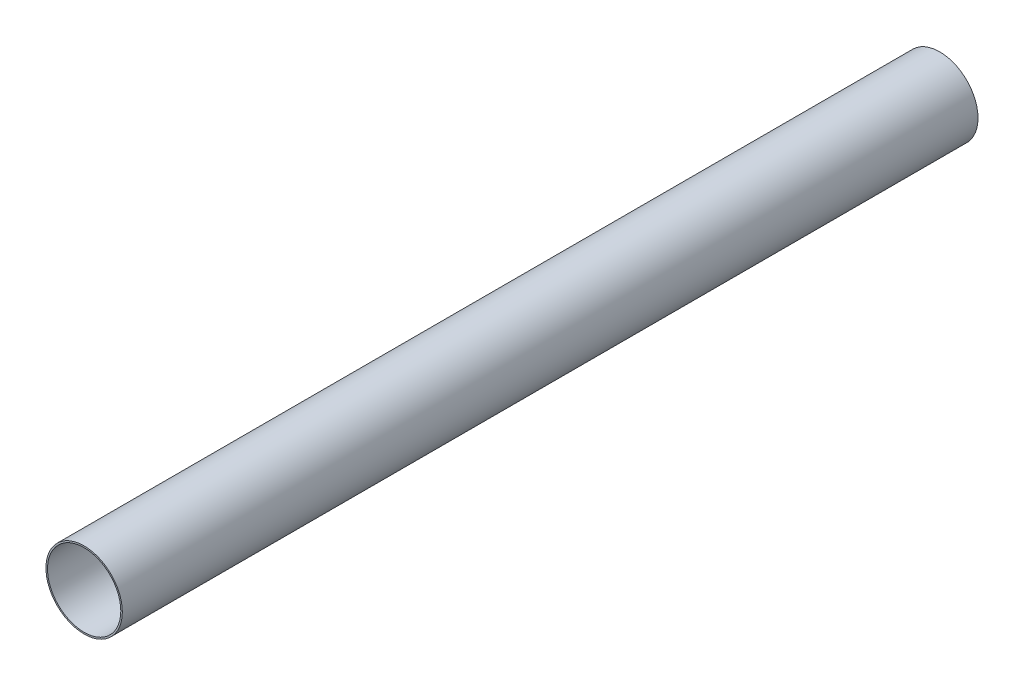
ISO-10303-21;
HEADER;
FILE_DESCRIPTION(('STEP AP214'),'2;1');
FILE_NAME('part.step','',(''),(''),'','','');
FILE_SCHEMA(('AUTOMOTIVE_DESIGN { 1 0 10303 214 1 1 1 1 }'));
ENDSEC;
DATA;
#1=APPLICATION_CONTEXT('core data for automotive mechanical design processes');
#2=APPLICATION_PROTOCOL_DEFINITION('international standard','automotive_design',2000,#1);
#3=PRODUCT_CONTEXT('',#1,'mechanical');
#4=PRODUCT('Part','Part','',(#3));
#5=PRODUCT_RELATED_PRODUCT_CATEGORY('part','',(#4));
#6=PRODUCT_DEFINITION_FORMATION('','',#4);
#7=PRODUCT_DEFINITION_CONTEXT('part definition',#1,'design');
#8=PRODUCT_DEFINITION('design','',#6,#7);
#9=PRODUCT_DEFINITION_SHAPE('','',#8);
#10=(LENGTH_UNIT() NAMED_UNIT(*) SI_UNIT(.MILLI.,.METRE.));
#11=(NAMED_UNIT(*) PLANE_ANGLE_UNIT() SI_UNIT($,.RADIAN.));
#12=(NAMED_UNIT(*) SI_UNIT($,.STERADIAN.) SOLID_ANGLE_UNIT());
#13=UNCERTAINTY_MEASURE_WITH_UNIT(LENGTH_MEASURE(1.E-05),#10,'distance_accuracy_value','');
#14=(GEOMETRIC_REPRESENTATION_CONTEXT(3) GLOBAL_UNCERTAINTY_ASSIGNED_CONTEXT((#13)) GLOBAL_UNIT_ASSIGNED_CONTEXT((#10,
#11,#12)) REPRESENTATION_CONTEXT('',''));
#15=CARTESIAN_POINT('',(0.,0.,0.));
#16=DIRECTION('',(0.,0.,1.));
#17=DIRECTION('',(1.,0.,0.));
#18=AXIS2_PLACEMENT_3D('',#15,#16,#17);
#19=CARTESIAN_POINT('',(0.,0.,1778.));
#20=DIRECTION('',(0.,0.,1.));
#21=DIRECTION('',(1.,0.,0.));
#22=AXIS2_PLACEMENT_3D('',#19,#20,#21);
#23=PLANE('',#22);
#24=CARTESIAN_POINT('',(0.,0.,1778.));
#25=DIRECTION('',(0.,0.,1.));
#26=DIRECTION('',(1.,0.,0.));
#27=AXIS2_PLACEMENT_3D('',#24,#25,#26);
#28=CIRCLE('',#27,79.375);
#29=CARTESIAN_POINT('',(79.375,0.,1778.));
#30=VERTEX_POINT('',#29);
#31=EDGE_CURVE('E10',#30,#30,#28,.T.);
#32=ORIENTED_EDGE('',*,*,#31,.T.);
#33=EDGE_LOOP('',(#32));
#34=FACE_BOUND('',#33,.T.);
#35=CARTESIAN_POINT('',(0.,0.,1778.));
#36=DIRECTION('',(0.,0.,1.));
#37=DIRECTION('',(1.,0.,0.));
#38=AXIS2_PLACEMENT_3D('',#35,#36,#37);
#39=CIRCLE('',#38,76.2);
#40=CARTESIAN_POINT('',(76.2,0.,1778.));
#41=VERTEX_POINT('',#40);
#42=EDGE_CURVE('E56',#41,#41,#39,.T.);
#43=ORIENTED_EDGE('',*,*,#42,.F.);
#44=EDGE_LOOP('',(#43));
#45=FACE_BOUND('',#44,.T.);
#46=ADVANCED_FACE('F43',(#34,#45),#23,.T.);
#47=CARTESIAN_POINT('',(0.,0.,0.));
#48=DIRECTION('',(0.,0.,1.));
#49=DIRECTION('',(1.,0.,0.));
#50=AXIS2_PLACEMENT_3D('',#47,#48,#49);
#51=PLANE('',#50);
#52=CARTESIAN_POINT('',(0.,0.,0.));
#53=DIRECTION('',(0.,0.,1.));
#54=DIRECTION('',(1.,0.,0.));
#55=AXIS2_PLACEMENT_3D('',#52,#53,#54);
#56=CIRCLE('',#55,79.375);
#57=CARTESIAN_POINT('',(79.375,0.,0.));
#58=VERTEX_POINT('',#57);
#59=EDGE_CURVE('E47',#58,#58,#56,.T.);
#60=ORIENTED_EDGE('',*,*,#59,.F.);
#61=EDGE_LOOP('',(#60));
#62=FACE_BOUND('',#61,.T.);
#63=CARTESIAN_POINT('',(0.,0.,0.));
#64=DIRECTION('',(0.,0.,1.));
#65=DIRECTION('',(1.,0.,0.));
#66=AXIS2_PLACEMENT_3D('',#63,#64,#65);
#67=CIRCLE('',#66,76.2);
#68=CARTESIAN_POINT('',(76.2,0.,0.));
#69=VERTEX_POINT('',#68);
#70=EDGE_CURVE('E58',#69,#69,#67,.T.);
#71=ORIENTED_EDGE('',*,*,#70,.T.);
#72=EDGE_LOOP('',(#71));
#73=FACE_BOUND('',#72,.T.);
#74=ADVANCED_FACE('F70',(#62,#73),#51,.F.);
#75=CARTESIAN_POINT('',(0.,0.,1778.));
#76=DIRECTION('',(0.,0.,-1.));
#77=DIRECTION('',(-1.,0.,0.));
#78=AXIS2_PLACEMENT_3D('',#75,#76,#77);
#79=CYLINDRICAL_SURFACE('',#78,79.375);
#80=ORIENTED_EDGE('',*,*,#31,.F.);
#81=EDGE_LOOP('',(#80));
#82=FACE_BOUND('',#81,.T.);
#83=ORIENTED_EDGE('',*,*,#59,.T.);
#84=EDGE_LOOP('',(#83));
#85=FACE_BOUND('',#84,.T.);
#86=ADVANCED_FACE('F45',(#82,#85),#79,.T.);
#87=CARTESIAN_POINT('',(0.,0.,1778.));
#88=DIRECTION('',(0.,0.,-1.));
#89=DIRECTION('',(-1.,0.,0.));
#90=AXIS2_PLACEMENT_3D('',#87,#88,#89);
#91=CYLINDRICAL_SURFACE('',#90,76.2);
#92=ORIENTED_EDGE('',*,*,#42,.T.);
#93=EDGE_LOOP('',(#92));
#94=FACE_BOUND('',#93,.T.);
#95=ORIENTED_EDGE('',*,*,#70,.F.);
#96=EDGE_LOOP('',(#95));
#97=FACE_BOUND('',#96,.T.);
#98=ADVANCED_FACE('F66',(#94,#97),#91,.F.);
#99=CLOSED_SHELL('',(#46,#74,#86,#98));
#100=MANIFOLD_SOLID_BREP('B2',#99);
#101=ADVANCED_BREP_SHAPE_REPRESENTATION('',(#18,#100),#14);
#102=SHAPE_DEFINITION_REPRESENTATION(#9,#101);
ENDSEC;
END-ISO-10303-21;
